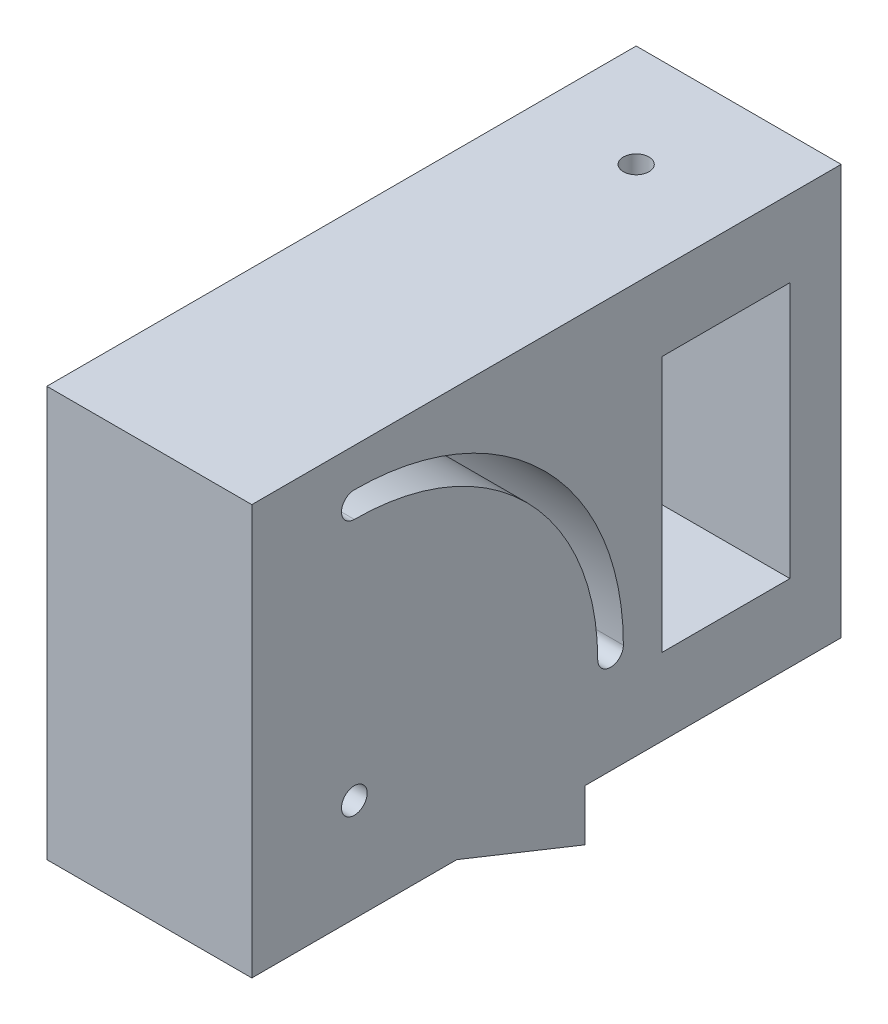
ISO-10303-21;
HEADER;
FILE_DESCRIPTION(('STEP AP214'),'2;1');
FILE_NAME('part.step','',(''),(''),'','','');
FILE_SCHEMA(('AUTOMOTIVE_DESIGN { 1 0 10303 214 1 1 1 1 }'));
ENDSEC;
DATA;
#1=APPLICATION_CONTEXT('core data for automotive mechanical design processes');
#2=APPLICATION_PROTOCOL_DEFINITION('international standard','automotive_design',2000,#1);
#3=PRODUCT_CONTEXT('',#1,'mechanical');
#4=PRODUCT('Part','Part','',(#3));
#5=PRODUCT_RELATED_PRODUCT_CATEGORY('part','',(#4));
#6=PRODUCT_DEFINITION_FORMATION('','',#4);
#7=PRODUCT_DEFINITION_CONTEXT('part definition',#1,'design');
#8=PRODUCT_DEFINITION('design','',#6,#7);
#9=PRODUCT_DEFINITION_SHAPE('','',#8);
#10=(LENGTH_UNIT() NAMED_UNIT(*) SI_UNIT(.MILLI.,.METRE.));
#11=(NAMED_UNIT(*) PLANE_ANGLE_UNIT() SI_UNIT($,.RADIAN.));
#12=(NAMED_UNIT(*) SI_UNIT($,.STERADIAN.) SOLID_ANGLE_UNIT());
#13=UNCERTAINTY_MEASURE_WITH_UNIT(LENGTH_MEASURE(1.E-05),#10,'distance_accuracy_value','');
#14=(GEOMETRIC_REPRESENTATION_CONTEXT(3) GLOBAL_UNCERTAINTY_ASSIGNED_CONTEXT((#13)) GLOBAL_UNIT_ASSIGNED_CONTEXT((#10,
#11,#12)) REPRESENTATION_CONTEXT('',''));
#15=CARTESIAN_POINT('',(0.,0.,0.));
#16=DIRECTION('',(0.,0.,1.));
#17=DIRECTION('',(1.,0.,0.));
#18=AXIS2_PLACEMENT_3D('',#15,#16,#17);
#19=CARTESIAN_POINT('',(0.,-42.059569583931,40.));
#20=DIRECTION('',(0.,0.,1.));
#21=DIRECTION('',(0.,-1.,0.));
#22=AXIS2_PLACEMENT_3D('',#19,#20,#21);
#23=PLANE('',#22);
#24=DIRECTION('',(0.,1.,0.));
#25=VECTOR('',#24,1.);
#26=CARTESIAN_POINT('',(-40.,-42.059569583931,40.));
#27=LINE('',#26,#25);
#28=CARTESIAN_POINT('',(-40.,-42.059569583931,40.));
#29=VERTEX_POINT('',#28);
#30=CARTESIAN_POINT('',(-40.,37.9404304160689,40.));
#31=VERTEX_POINT('',#30);
#32=EDGE_CURVE('E272',#29,#31,#27,.T.);
#33=ORIENTED_EDGE('',*,*,#32,.F.);
#34=DIRECTION('',(-1.,0.,0.));
#35=VECTOR('',#34,1.);
#36=CARTESIAN_POINT('',(0.,-42.059569583931,40.));
#37=LINE('',#36,#35);
#38=CARTESIAN_POINT('',(0.,-42.059569583931,40.));
#39=VERTEX_POINT('',#38);
#40=EDGE_CURVE('E227',#39,#29,#37,.T.);
#41=ORIENTED_EDGE('',*,*,#40,.F.);
#42=DIRECTION('',(0.,1.,0.));
#43=VECTOR('',#42,1.);
#44=CARTESIAN_POINT('',(0.,-42.059569583931,40.));
#45=LINE('',#44,#43);
#46=CARTESIAN_POINT('',(0.,37.9404304160689,40.));
#47=VERTEX_POINT('',#46);
#48=EDGE_CURVE('E212',#39,#47,#45,.T.);
#49=ORIENTED_EDGE('',*,*,#48,.T.);
#50=DIRECTION('',(-1.,0.,0.));
#51=VECTOR('',#50,1.);
#52=CARTESIAN_POINT('',(0.,37.9404304160689,40.));
#53=LINE('',#52,#51);
#54=EDGE_CURVE('E268',#47,#31,#53,.T.);
#55=ORIENTED_EDGE('',*,*,#54,.T.);
#56=EDGE_LOOP('',(#33,#41,#49,#55));
#57=FACE_BOUND('',#56,.T.);
#58=ADVANCED_FACE('F32',(#57),#23,.T.);
#59=CARTESIAN_POINT('',(0.,-42.0595695839308,0.));
#60=DIRECTION('',(0.,-1.,0.));
#61=DIRECTION('',(0.,0.,-1.));
#62=AXIS2_PLACEMENT_3D('',#59,#60,#61);
#63=PLANE('',#62);
#64=DIRECTION('',(0.,0.,1.));
#65=VECTOR('',#64,1.);
#66=CARTESIAN_POINT('',(-40.,-42.0595695839308,0.));
#67=LINE('',#66,#65);
#68=CARTESIAN_POINT('',(-40.,-42.0595695839308,0.));
#69=VERTEX_POINT('',#68);
#70=EDGE_CURVE('E278',#69,#29,#67,.T.);
#71=ORIENTED_EDGE('',*,*,#70,.F.);
#72=DIRECTION('',(-1.,0.,0.));
#73=VECTOR('',#72,1.);
#74=CARTESIAN_POINT('',(0.,-42.0595695839308,0.));
#75=LINE('',#74,#73);
#76=CARTESIAN_POINT('',(0.,-42.0595695839308,0.));
#77=VERTEX_POINT('',#76);
#78=EDGE_CURVE('E309',#77,#69,#75,.T.);
#79=ORIENTED_EDGE('',*,*,#78,.F.);
#80=DIRECTION('',(0.,0.,1.));
#81=VECTOR('',#80,1.);
#82=CARTESIAN_POINT('',(0.,-42.0595695839308,0.));
#83=LINE('',#82,#81);
#84=EDGE_CURVE('E283',#77,#39,#83,.T.);
#85=ORIENTED_EDGE('',*,*,#84,.T.);
#86=ORIENTED_EDGE('',*,*,#40,.T.);
#87=EDGE_LOOP('',(#71,#79,#85,#86));
#88=FACE_BOUND('',#87,.T.);
#89=ADVANCED_FACE('F314',(#88),#63,.T.);
#90=CARTESIAN_POINT('',(0.,-52.059569583931,-25.0000000000001));
#91=DIRECTION('',(0.,-0.928476690885258,0.371390676354108));
#92=DIRECTION('',(0.,-0.371390676354108,-0.928476690885258));
#93=AXIS2_PLACEMENT_3D('',#90,#91,#92);
#94=PLANE('',#93);
#95=DIRECTION('',(0.,0.371390676354108,0.928476690885258));
#96=VECTOR('',#95,1.);
#97=CARTESIAN_POINT('',(-40.,-52.059569583931,-25.0000000000001));
#98=LINE('',#97,#96);
#99=CARTESIAN_POINT('',(-40.,-52.059569583931,-25.0000000000001));
#100=VERTEX_POINT('',#99);
#101=EDGE_CURVE('E288',#100,#69,#98,.T.);
#102=ORIENTED_EDGE('',*,*,#101,.F.);
#103=DIRECTION('',(-1.,0.,0.));
#104=VECTOR('',#103,1.);
#105=CARTESIAN_POINT('',(0.,-52.059569583931,-25.0000000000001));
#106=LINE('',#105,#104);
#107=CARTESIAN_POINT('',(0.,-52.059569583931,-25.0000000000001));
#108=VERTEX_POINT('',#107);
#109=EDGE_CURVE('E306',#108,#100,#106,.T.);
#110=ORIENTED_EDGE('',*,*,#109,.F.);
#111=DIRECTION('',(0.,0.371390676354108,0.928476690885258));
#112=VECTOR('',#111,1.);
#113=CARTESIAN_POINT('',(0.,-52.059569583931,-25.0000000000001));
#114=LINE('',#113,#112);
#115=EDGE_CURVE('E296',#108,#77,#114,.T.);
#116=ORIENTED_EDGE('',*,*,#115,.T.);
#117=ORIENTED_EDGE('',*,*,#78,.T.);
#118=EDGE_LOOP('',(#102,#110,#116,#117));
#119=FACE_BOUND('',#118,.T.);
#120=ADVANCED_FACE('F326',(#119),#94,.T.);
#121=CARTESIAN_POINT('',(0.,37.9404304160689,-25.0000000000002));
#122=DIRECTION('',(0.,0.,-1.));
#123=DIRECTION('',(0.,1.,0.));
#124=AXIS2_PLACEMENT_3D('',#121,#122,#123);
#125=PLANE('',#124);
#126=DIRECTION('',(-1.,0.,0.));
#127=VECTOR('',#126,1.);
#128=CARTESIAN_POINT('',(-40.,-42.0595695839309,-25.0000000000001));
#129=LINE('',#128,#127);
#130=CARTESIAN_POINT('',(0.,-42.0595695839309,-25.0000000000001));
#131=VERTEX_POINT('',#130);
#132=CARTESIAN_POINT('',(-40.,-42.0595695839309,-25.0000000000001));
#133=VERTEX_POINT('',#132);
#134=EDGE_CURVE('E197',#131,#133,#129,.T.);
#135=ORIENTED_EDGE('',*,*,#134,.F.);
#136=DIRECTION('',(0.,-1.,0.));
#137=VECTOR('',#136,1.);
#138=CARTESIAN_POINT('',(0.,37.9404304160689,-25.0000000000002));
#139=LINE('',#138,#137);
#140=EDGE_CURVE('E294',#131,#108,#139,.T.);
#141=ORIENTED_EDGE('',*,*,#140,.T.);
#142=ORIENTED_EDGE('',*,*,#109,.T.);
#143=DIRECTION('',(0.,-1.,0.));
#144=VECTOR('',#143,1.);
#145=CARTESIAN_POINT('',(-40.,37.9404304160689,-25.0000000000002));
#146=LINE('',#145,#144);
#147=EDGE_CURVE('E271',#133,#100,#146,.T.);
#148=ORIENTED_EDGE('',*,*,#147,.F.);
#149=EDGE_LOOP('',(#135,#141,#142,#148));
#150=FACE_BOUND('',#149,.T.);
#151=ADVANCED_FACE('F263',(#150),#125,.T.);
#152=CARTESIAN_POINT('',(0.,37.9404304160689,40.));
#153=DIRECTION('',(0.,1.,0.));
#154=DIRECTION('',(0.,0.,1.));
#155=AXIS2_PLACEMENT_3D('',#152,#153,#154);
#156=PLANE('',#155);
#157=CARTESIAN_POINT('',(-20.,37.9404304160689,-55.0000000000001));
#158=DIRECTION('',(0.,1.,0.));
#159=DIRECTION('',(0.,0.,1.));
#160=AXIS2_PLACEMENT_3D('',#157,#158,#159);
#161=CIRCLE('',#160,2.50000000000003);
#162=CARTESIAN_POINT('',(-20.,37.9404304160689,-52.5000000000001));
#163=VERTEX_POINT('',#162);
#164=EDGE_CURVE('E253',#163,#163,#161,.T.);
#165=ORIENTED_EDGE('',*,*,#164,.F.);
#166=EDGE_LOOP('',(#165));
#167=FACE_BOUND('',#166,.T.);
#168=DIRECTION('',(0.,0.,-1.));
#169=VECTOR('',#168,1.);
#170=CARTESIAN_POINT('',(-40.,37.9404304160689,40.));
#171=LINE('',#170,#169);
#172=CARTESIAN_POINT('',(-40.,37.9404304160689,-75.));
#173=VERTEX_POINT('',#172);
#174=EDGE_CURVE('E266',#31,#173,#171,.T.);
#175=ORIENTED_EDGE('',*,*,#174,.F.);
#176=ORIENTED_EDGE('',*,*,#54,.F.);
#177=DIRECTION('',(0.,0.,-1.));
#178=VECTOR('',#177,1.);
#179=CARTESIAN_POINT('',(0.,37.9404304160689,40.));
#180=LINE('',#179,#178);
#181=CARTESIAN_POINT('',(0.,37.9404304160689,-75.));
#182=VERTEX_POINT('',#181);
#183=EDGE_CURVE('E297',#47,#182,#180,.T.);
#184=ORIENTED_EDGE('',*,*,#183,.T.);
#185=DIRECTION('',(1.,0.,0.));
#186=VECTOR('',#185,1.);
#187=CARTESIAN_POINT('',(0.,37.9404304160689,-75.));
#188=LINE('',#187,#186);
#189=EDGE_CURVE('E204',#173,#182,#188,.T.);
#190=ORIENTED_EDGE('',*,*,#189,.F.);
#191=EDGE_LOOP('',(#175,#176,#184,#190));
#192=FACE_BOUND('',#191,.T.);
#193=ADVANCED_FACE('F260',(#167,#192),#156,.T.);
#194=CARTESIAN_POINT('',(0.,0.,0.));
#195=DIRECTION('',(-1.,0.,0.));
#196=DIRECTION('',(0.,0.,1.));
#197=AXIS2_PLACEMENT_3D('',#194,#195,#196);
#198=PLANE('',#197);
#199=CARTESIAN_POINT('',(0.,-22.0595695839311,20.));
#200=DIRECTION('',(1.,0.,0.));
#201=DIRECTION('',(0.,0.,-1.));
#202=AXIS2_PLACEMENT_3D('',#199,#200,#201);
#203=CIRCLE('',#202,2.4999999999999);
#204=CARTESIAN_POINT('',(0.,-22.0595695839311,17.5000000000001));
#205=VERTEX_POINT('',#204);
#206=EDGE_CURVE('E247',#205,#205,#203,.T.);
#207=ORIENTED_EDGE('',*,*,#206,.F.);
#208=EDGE_LOOP('',(#207));
#209=FACE_BOUND('',#208,.T.);
#210=DIRECTION('',(0.,1.,0.));
#211=VECTOR('',#210,1.);
#212=CARTESIAN_POINT('',(0.,-27.0595695839312,-65.0000000000001));
#213=LINE('',#212,#211);
#214=CARTESIAN_POINT('',(0.,-27.0595695839312,-65.0000000000001));
#215=VERTEX_POINT('',#214);
#216=CARTESIAN_POINT('',(0.,22.9404304160689,-65.0000000000001));
#217=VERTEX_POINT('',#216);
#218=EDGE_CURVE('E149',#215,#217,#213,.T.);
#219=ORIENTED_EDGE('',*,*,#218,.F.);
#220=DIRECTION('',(0.,0.,-1.));
#221=VECTOR('',#220,1.);
#222=CARTESIAN_POINT('',(0.,-27.0595695839312,-39.9999999620001));
#223=LINE('',#222,#221);
#224=CARTESIAN_POINT('',(0.,-27.0595695839312,-39.9999999620001));
#225=VERTEX_POINT('',#224);
#226=EDGE_CURVE('E46',#225,#215,#223,.T.);
#227=ORIENTED_EDGE('',*,*,#226,.F.);
#228=DIRECTION('',(0.,-1.,0.));
#229=VECTOR('',#228,1.);
#230=CARTESIAN_POINT('',(0.,22.9404304160689,-39.9999999620001));
#231=LINE('',#230,#229);
#232=CARTESIAN_POINT('',(0.,22.9404304160689,-39.9999999620001));
#233=VERTEX_POINT('',#232);
#234=EDGE_CURVE('E156',#233,#225,#231,.T.);
#235=ORIENTED_EDGE('',*,*,#234,.F.);
#236=DIRECTION('',(0.,0.,1.));
#237=VECTOR('',#236,1.);
#238=CARTESIAN_POINT('',(0.,22.9404304160689,-65.0000000000001));
#239=LINE('',#238,#237);
#240=EDGE_CURVE('E140',#217,#233,#239,.T.);
#241=ORIENTED_EDGE('',*,*,#240,.F.);
#242=EDGE_LOOP('',(#219,#227,#235,#241));
#243=FACE_BOUND('',#242,.T.);
#244=CARTESIAN_POINT('',(0.,27.9404304160689,19.9999999999849));
#245=DIRECTION('',(-1.,0.,0.));
#246=DIRECTION('',(0.,0.,1.));
#247=AXIS2_PLACEMENT_3D('',#244,#245,#246);
#248=CIRCLE('',#247,2.50000000000001);
#249=CARTESIAN_POINT('',(0.,25.4404304160689,19.9999999999857));
#250=VERTEX_POINT('',#249);
#251=CARTESIAN_POINT('',(0.,30.4404304160689,19.9999999999841));
#252=VERTEX_POINT('',#251);
#253=EDGE_CURVE('E191',#250,#252,#248,.T.);
#254=ORIENTED_EDGE('',*,*,#253,.T.);
#255=CARTESIAN_POINT('',(0.,-22.0595695839311,20.));
#256=DIRECTION('',(-1.,0.,0.));
#257=DIRECTION('',(0.,0.,1.));
#258=AXIS2_PLACEMENT_3D('',#255,#256,#257);
#259=CIRCLE('',#258,52.5);
#260=CARTESIAN_POINT('',(0.,-22.0595695839311,-32.4999999999999));
#261=VERTEX_POINT('',#260);
#262=EDGE_CURVE('E194',#252,#261,#259,.T.);
#263=ORIENTED_EDGE('',*,*,#262,.T.);
#264=CARTESIAN_POINT('',(0.,-22.0595695839311,-29.9999999999999));
#265=DIRECTION('',(-1.,0.,0.));
#266=DIRECTION('',(0.,0.,1.));
#267=AXIS2_PLACEMENT_3D('',#264,#265,#266);
#268=CIRCLE('',#267,2.50000000000001);
#269=CARTESIAN_POINT('',(0.,-22.0595695839311,-27.4999999999999));
#270=VERTEX_POINT('',#269);
#271=EDGE_CURVE('E179',#261,#270,#268,.T.);
#272=ORIENTED_EDGE('',*,*,#271,.T.);
#273=CARTESIAN_POINT('',(0.,-22.0595695839311,20.));
#274=DIRECTION('',(-1.,0.,0.));
#275=DIRECTION('',(0.,0.,1.));
#276=AXIS2_PLACEMENT_3D('',#273,#274,#275);
#277=CIRCLE('',#276,47.5);
#278=EDGE_CURVE('E188',#270,#250,#277,.F.);
#279=ORIENTED_EDGE('',*,*,#278,.T.);
#280=EDGE_LOOP('',(#254,#263,#272,#279));
#281=FACE_BOUND('',#280,.T.);
#282=ORIENTED_EDGE('',*,*,#48,.F.);
#283=ORIENTED_EDGE('',*,*,#84,.F.);
#284=ORIENTED_EDGE('',*,*,#115,.F.);
#285=ORIENTED_EDGE('',*,*,#140,.F.);
#286=DIRECTION('',(0.,0.,1.));
#287=VECTOR('',#286,1.);
#288=CARTESIAN_POINT('',(0.,-42.059569583931,-75.));
#289=LINE('',#288,#287);
#290=CARTESIAN_POINT('',(0.,-42.059569583931,-75.));
#291=VERTEX_POINT('',#290);
#292=EDGE_CURVE('E209',#291,#131,#289,.T.);
#293=ORIENTED_EDGE('',*,*,#292,.F.);
#294=DIRECTION('',(0.,-1.,0.));
#295=VECTOR('',#294,1.);
#296=CARTESIAN_POINT('',(0.,-42.059569583931,-75.));
#297=LINE('',#296,#295);
#298=EDGE_CURVE('E207',#182,#291,#297,.T.);
#299=ORIENTED_EDGE('',*,*,#298,.F.);
#300=ORIENTED_EDGE('',*,*,#183,.F.);
#301=EDGE_LOOP('',(#282,#283,#284,#285,#293,#299,#300));
#302=FACE_BOUND('',#301,.T.);
#303=ADVANCED_FACE('F153',(#209,#243,#281,#302),#198,.F.);
#304=CARTESIAN_POINT('',(-40.,0.,0.));
#305=DIRECTION('',(-1.,0.,0.));
#306=DIRECTION('',(0.,0.,1.));
#307=AXIS2_PLACEMENT_3D('',#304,#305,#306);
#308=PLANE('',#307);
#309=CARTESIAN_POINT('',(-40.,-22.0595695839311,20.));
#310=DIRECTION('',(-1.,0.,0.));
#311=DIRECTION('',(0.,0.,1.));
#312=AXIS2_PLACEMENT_3D('',#309,#310,#311);
#313=CIRCLE('',#312,2.49999999999989);
#314=CARTESIAN_POINT('',(-40.,-22.0595695839311,22.4999999999999));
#315=VERTEX_POINT('',#314);
#316=EDGE_CURVE('E244',#315,#315,#313,.T.);
#317=ORIENTED_EDGE('',*,*,#316,.F.);
#318=EDGE_LOOP('',(#317));
#319=FACE_BOUND('',#318,.T.);
#320=DIRECTION('',(0.,0.,1.));
#321=VECTOR('',#320,1.);
#322=CARTESIAN_POINT('',(-40.,-27.0595695839312,0.));
#323=LINE('',#322,#321);
#324=CARTESIAN_POINT('',(-40.,-27.0595695839312,-65.0000000000001));
#325=VERTEX_POINT('',#324);
#326=CARTESIAN_POINT('',(-40.,-27.0595695839312,-39.9999999620001));
#327=VERTEX_POINT('',#326);
#328=EDGE_CURVE('E11',#325,#327,#323,.T.);
#329=ORIENTED_EDGE('',*,*,#328,.F.);
#330=DIRECTION('',(0.,-1.,0.));
#331=VECTOR('',#330,1.);
#332=CARTESIAN_POINT('',(-40.,0.,-65.0000000000001));
#333=LINE('',#332,#331);
#334=CARTESIAN_POINT('',(-40.,22.9404304160689,-65.0000000000001));
#335=VERTEX_POINT('',#334);
#336=EDGE_CURVE('E225',#335,#325,#333,.T.);
#337=ORIENTED_EDGE('',*,*,#336,.F.);
#338=DIRECTION('',(0.,0.,-1.));
#339=VECTOR('',#338,1.);
#340=CARTESIAN_POINT('',(-40.,22.9404304160689,0.));
#341=LINE('',#340,#339);
#342=CARTESIAN_POINT('',(-40.,22.9404304160689,-39.9999999620001));
#343=VERTEX_POINT('',#342);
#344=EDGE_CURVE('E143',#343,#335,#341,.T.);
#345=ORIENTED_EDGE('',*,*,#344,.F.);
#346=DIRECTION('',(0.,1.,0.));
#347=VECTOR('',#346,1.);
#348=CARTESIAN_POINT('',(-40.,0.,-39.9999999620001));
#349=LINE('',#348,#347);
#350=EDGE_CURVE('E39',#327,#343,#349,.T.);
#351=ORIENTED_EDGE('',*,*,#350,.F.);
#352=EDGE_LOOP('',(#329,#337,#345,#351));
#353=FACE_BOUND('',#352,.T.);
#354=CARTESIAN_POINT('',(-40.,-22.0595695839311,20.));
#355=DIRECTION('',(-1.,0.,0.));
#356=DIRECTION('',(0.,0.,1.));
#357=AXIS2_PLACEMENT_3D('',#354,#355,#356);
#358=CIRCLE('',#357,52.5);
#359=CARTESIAN_POINT('',(-40.,30.4404304160689,19.9999999999841));
#360=VERTEX_POINT('',#359);
#361=CARTESIAN_POINT('',(-40.,-22.0595695839311,-32.4999999999999));
#362=VERTEX_POINT('',#361);
#363=EDGE_CURVE('E163',#360,#362,#358,.T.);
#364=ORIENTED_EDGE('',*,*,#363,.F.);
#365=CARTESIAN_POINT('',(-40.,27.9404304160689,19.9999999999849));
#366=DIRECTION('',(-1.,0.,0.));
#367=DIRECTION('',(0.,0.,1.));
#368=AXIS2_PLACEMENT_3D('',#365,#366,#367);
#369=CIRCLE('',#368,2.50000000000001);
#370=CARTESIAN_POINT('',(-40.,25.4404304160689,19.9999999999857));
#371=VERTEX_POINT('',#370);
#372=EDGE_CURVE('E173',#371,#360,#369,.T.);
#373=ORIENTED_EDGE('',*,*,#372,.F.);
#374=CARTESIAN_POINT('',(-40.,-22.0595695839311,20.));
#375=DIRECTION('',(1.,0.,0.));
#376=DIRECTION('',(0.,0.,-1.));
#377=AXIS2_PLACEMENT_3D('',#374,#375,#376);
#378=CIRCLE('',#377,47.5);
#379=CARTESIAN_POINT('',(-40.,-22.0595695839311,-27.4999999999999));
#380=VERTEX_POINT('',#379);
#381=EDGE_CURVE('E170',#380,#371,#378,.T.);
#382=ORIENTED_EDGE('',*,*,#381,.F.);
#383=CARTESIAN_POINT('',(-40.,-22.0595695839311,-29.9999999999999));
#384=DIRECTION('',(-1.,0.,0.));
#385=DIRECTION('',(0.,0.,1.));
#386=AXIS2_PLACEMENT_3D('',#383,#384,#385);
#387=CIRCLE('',#386,2.50000000000001);
#388=EDGE_CURVE('E167',#362,#380,#387,.T.);
#389=ORIENTED_EDGE('',*,*,#388,.F.);
#390=EDGE_LOOP('',(#364,#373,#382,#389));
#391=FACE_BOUND('',#390,.T.);
#392=ORIENTED_EDGE('',*,*,#32,.T.);
#393=ORIENTED_EDGE('',*,*,#174,.T.);
#394=DIRECTION('',(0.,1.,0.));
#395=VECTOR('',#394,1.);
#396=CARTESIAN_POINT('',(-40.,37.9404304160689,-75.));
#397=LINE('',#396,#395);
#398=CARTESIAN_POINT('',(-40.,-42.0595695839309,-75.));
#399=VERTEX_POINT('',#398);
#400=EDGE_CURVE('E201',#399,#173,#397,.T.);
#401=ORIENTED_EDGE('',*,*,#400,.F.);
#402=DIRECTION('',(0.,0.,1.));
#403=VECTOR('',#402,1.);
#404=CARTESIAN_POINT('',(-40.,-42.0595695839309,-75.));
#405=LINE('',#404,#403);
#406=EDGE_CURVE('E222',#399,#133,#405,.T.);
#407=ORIENTED_EDGE('',*,*,#406,.T.);
#408=ORIENTED_EDGE('',*,*,#147,.T.);
#409=ORIENTED_EDGE('',*,*,#101,.T.);
#410=ORIENTED_EDGE('',*,*,#70,.T.);
#411=EDGE_LOOP('',(#392,#393,#401,#407,#408,#409,#410));
#412=FACE_BOUND('',#411,.T.);
#413=ADVANCED_FACE('F234',(#319,#353,#391,#412),#308,.T.);
#414=CARTESIAN_POINT('',(-40.,-42.0595695839309,-75.));
#415=DIRECTION('',(0.,1.,0.));
#416=DIRECTION('',(-1.,0.,0.));
#417=AXIS2_PLACEMENT_3D('',#414,#415,#416);
#418=PLANE('',#417);
#419=CARTESIAN_POINT('',(-20.,-42.0595695839309,-55.0000000000001));
#420=DIRECTION('',(0.,1.,0.));
#421=DIRECTION('',(-1.,0.,0.));
#422=AXIS2_PLACEMENT_3D('',#419,#420,#421);
#423=CIRCLE('',#422,2.50000000000004);
#424=CARTESIAN_POINT('',(-22.5,-42.0595695839309,-55.0000000000001));
#425=VERTEX_POINT('',#424);
#426=EDGE_CURVE('E237',#425,#425,#423,.T.);
#427=ORIENTED_EDGE('',*,*,#426,.T.);
#428=EDGE_LOOP('',(#427));
#429=FACE_BOUND('',#428,.T.);
#430=ORIENTED_EDGE('',*,*,#134,.T.);
#431=ORIENTED_EDGE('',*,*,#406,.F.);
#432=DIRECTION('',(-1.,0.,0.));
#433=VECTOR('',#432,1.);
#434=CARTESIAN_POINT('',(-40.,-42.0595695839309,-75.));
#435=LINE('',#434,#433);
#436=EDGE_CURVE('E198',#291,#399,#435,.T.);
#437=ORIENTED_EDGE('',*,*,#436,.F.);
#438=ORIENTED_EDGE('',*,*,#292,.T.);
#439=EDGE_LOOP('',(#430,#431,#437,#438));
#440=FACE_BOUND('',#439,.T.);
#441=ADVANCED_FACE('F324',(#429,#440),#418,.F.);
#442=CARTESIAN_POINT('',(0.,0.,-75.));
#443=DIRECTION('',(0.,0.,1.));
#444=DIRECTION('',(0.,-1.,0.));
#445=AXIS2_PLACEMENT_3D('',#442,#443,#444);
#446=PLANE('',#445);
#447=ORIENTED_EDGE('',*,*,#436,.T.);
#448=ORIENTED_EDGE('',*,*,#400,.T.);
#449=ORIENTED_EDGE('',*,*,#189,.T.);
#450=ORIENTED_EDGE('',*,*,#298,.T.);
#451=EDGE_LOOP('',(#447,#448,#449,#450));
#452=FACE_BOUND('',#451,.T.);
#453=ADVANCED_FACE('F320',(#452),#446,.F.);
#454=CARTESIAN_POINT('',(5.00000000014378E-05,-22.0595695839311,20.));
#455=DIRECTION('',(-1.,0.,0.));
#456=DIRECTION('',(0.,0.,1.));
#457=AXIS2_PLACEMENT_3D('',#454,#455,#456);
#458=CYLINDRICAL_SURFACE('',#457,52.5);
#459=DIRECTION('',(-1.,0.,0.));
#460=VECTOR('',#459,1.);
#461=CARTESIAN_POINT('',(5.00000000014378E-05,30.4404304160689,19.9999999999841));
#462=LINE('',#461,#460);
#463=EDGE_CURVE('E177',#252,#360,#462,.T.);
#464=ORIENTED_EDGE('',*,*,#463,.T.);
#465=ORIENTED_EDGE('',*,*,#363,.T.);
#466=DIRECTION('',(-1.,0.,0.));
#467=VECTOR('',#466,1.);
#468=CARTESIAN_POINT('',(5.00000000014378E-05,-22.0595695839311,-32.4999999999999));
#469=LINE('',#468,#467);
#470=EDGE_CURVE('E176',#261,#362,#469,.T.);
#471=ORIENTED_EDGE('',*,*,#470,.F.);
#472=ORIENTED_EDGE('',*,*,#262,.F.);
#473=EDGE_LOOP('',(#464,#465,#471,#472));
#474=FACE_BOUND('',#473,.T.);
#475=ADVANCED_FACE('F362',(#474),#458,.F.);
#476=CARTESIAN_POINT('',(5.00000000014378E-05,27.9404304160689,19.9999999999849));
#477=DIRECTION('',(-1.,0.,0.));
#478=DIRECTION('',(0.,0.,1.));
#479=AXIS2_PLACEMENT_3D('',#476,#477,#478);
#480=CYLINDRICAL_SURFACE('',#479,2.50000000000001);
#481=DIRECTION('',(-1.,0.,0.));
#482=VECTOR('',#481,1.);
#483=CARTESIAN_POINT('',(5.00000000014378E-05,25.4404304160689,19.9999999999857));
#484=LINE('',#483,#482);
#485=EDGE_CURVE('E180',#250,#371,#484,.T.);
#486=ORIENTED_EDGE('',*,*,#485,.T.);
#487=ORIENTED_EDGE('',*,*,#372,.T.);
#488=ORIENTED_EDGE('',*,*,#463,.F.);
#489=ORIENTED_EDGE('',*,*,#253,.F.);
#490=EDGE_LOOP('',(#486,#487,#488,#489));
#491=FACE_BOUND('',#490,.T.);
#492=ADVANCED_FACE('F373',(#491),#480,.F.);
#493=CARTESIAN_POINT('',(5.00000000014378E-05,-22.0595695839311,20.));
#494=DIRECTION('',(-1.,0.,0.));
#495=DIRECTION('',(0.,0.,1.));
#496=AXIS2_PLACEMENT_3D('',#493,#494,#495);
#497=CYLINDRICAL_SURFACE('',#496,47.5);
#498=DIRECTION('',(-1.,0.,0.));
#499=VECTOR('',#498,1.);
#500=CARTESIAN_POINT('',(5.00000000014378E-05,-22.0595695839311,-27.4999999999999));
#501=LINE('',#500,#499);
#502=EDGE_CURVE('E182',#270,#380,#501,.T.);
#503=ORIENTED_EDGE('',*,*,#502,.T.);
#504=ORIENTED_EDGE('',*,*,#381,.T.);
#505=ORIENTED_EDGE('',*,*,#485,.F.);
#506=ORIENTED_EDGE('',*,*,#278,.F.);
#507=EDGE_LOOP('',(#503,#504,#505,#506));
#508=FACE_BOUND('',#507,.T.);
#509=ADVANCED_FACE('F383',(#508),#497,.T.);
#510=CARTESIAN_POINT('',(5.00000000014378E-05,-22.0595695839311,-29.9999999999999));
#511=DIRECTION('',(-1.,0.,0.));
#512=DIRECTION('',(0.,0.,1.));
#513=AXIS2_PLACEMENT_3D('',#510,#511,#512);
#514=CYLINDRICAL_SURFACE('',#513,2.50000000000001);
#515=ORIENTED_EDGE('',*,*,#470,.T.);
#516=ORIENTED_EDGE('',*,*,#388,.T.);
#517=ORIENTED_EDGE('',*,*,#502,.F.);
#518=ORIENTED_EDGE('',*,*,#271,.F.);
#519=EDGE_LOOP('',(#515,#516,#517,#518));
#520=FACE_BOUND('',#519,.T.);
#521=ADVANCED_FACE('F393',(#520),#514,.F.);
#522=CARTESIAN_POINT('',(-40.00005,-27.0595695839312,-39.9999999620001));
#523=DIRECTION('',(0.,-1.,0.));
#524=DIRECTION('',(0.,0.,-1.));
#525=AXIS2_PLACEMENT_3D('',#522,#523,#524);
#526=PLANE('',#525);
#527=CARTESIAN_POINT('',(-20.,-27.0595695839314,-55.0000000000002));
#528=DIRECTION('',(0.,1.,0.));
#529=DIRECTION('',(0.,0.,1.));
#530=AXIS2_PLACEMENT_3D('',#527,#528,#529);
#531=CIRCLE('',#530,2.50000000000004);
#532=CARTESIAN_POINT('',(-20.,-27.0595695839313,-52.5000000000001));
#533=VERTEX_POINT('',#532);
#534=EDGE_CURVE('E239',#533,#533,#531,.T.);
#535=ORIENTED_EDGE('',*,*,#534,.F.);
#536=EDGE_LOOP('',(#535));
#537=FACE_BOUND('',#536,.T.);
#538=ORIENTED_EDGE('',*,*,#328,.T.);
#539=DIRECTION('',(1.,0.,0.));
#540=VECTOR('',#539,1.);
#541=CARTESIAN_POINT('',(-40.00005,-27.0595695839312,-39.9999999620001));
#542=LINE('',#541,#540);
#543=EDGE_CURVE('E161',#327,#225,#542,.T.);
#544=ORIENTED_EDGE('',*,*,#543,.T.);
#545=ORIENTED_EDGE('',*,*,#226,.T.);
#546=DIRECTION('',(1.,0.,0.));
#547=VECTOR('',#546,1.);
#548=CARTESIAN_POINT('',(-40.00005,-27.0595695839312,-65.0000000000001));
#549=LINE('',#548,#547);
#550=EDGE_CURVE('E146',#325,#215,#549,.T.);
#551=ORIENTED_EDGE('',*,*,#550,.F.);
#552=EDGE_LOOP('',(#538,#544,#545,#551));
#553=FACE_BOUND('',#552,.T.);
#554=ADVANCED_FACE('F236',(#537,#553),#526,.F.);
#555=CARTESIAN_POINT('',(-40.00005,22.9404304160689,-39.9999999620001));
#556=DIRECTION('',(0.,0.,1.));
#557=DIRECTION('',(0.,-1.,0.));
#558=AXIS2_PLACEMENT_3D('',#555,#556,#557);
#559=PLANE('',#558);
#560=ORIENTED_EDGE('',*,*,#350,.T.);
#561=DIRECTION('',(1.,0.,0.));
#562=VECTOR('',#561,1.);
#563=CARTESIAN_POINT('',(-40.00005,22.9404304160689,-39.9999999620001));
#564=LINE('',#563,#562);
#565=EDGE_CURVE('E145',#343,#233,#564,.T.);
#566=ORIENTED_EDGE('',*,*,#565,.T.);
#567=ORIENTED_EDGE('',*,*,#234,.T.);
#568=ORIENTED_EDGE('',*,*,#543,.F.);
#569=EDGE_LOOP('',(#560,#566,#567,#568));
#570=FACE_BOUND('',#569,.T.);
#571=ADVANCED_FACE('F231',(#570),#559,.F.);
#572=CARTESIAN_POINT('',(-40.00005,22.9404304160689,-65.0000000000001));
#573=DIRECTION('',(0.,1.,0.));
#574=DIRECTION('',(0.,0.,1.));
#575=AXIS2_PLACEMENT_3D('',#572,#573,#574);
#576=PLANE('',#575);
#577=CARTESIAN_POINT('',(-20.,22.9404304160689,-55.0000000000001));
#578=DIRECTION('',(0.,1.,0.));
#579=DIRECTION('',(0.,0.,1.));
#580=AXIS2_PLACEMENT_3D('',#577,#578,#579);
#581=CIRCLE('',#580,2.50000000000002);
#582=CARTESIAN_POINT('',(-20.,22.9404304160689,-52.5000000000001));
#583=VERTEX_POINT('',#582);
#584=EDGE_CURVE('E250',#583,#583,#581,.T.);
#585=ORIENTED_EDGE('',*,*,#584,.T.);
#586=EDGE_LOOP('',(#585));
#587=FACE_BOUND('',#586,.T.);
#588=ORIENTED_EDGE('',*,*,#344,.T.);
#589=DIRECTION('',(1.,0.,0.));
#590=VECTOR('',#589,1.);
#591=CARTESIAN_POINT('',(-40.00005,22.9404304160689,-65.0000000000001));
#592=LINE('',#591,#590);
#593=EDGE_CURVE('E54',#335,#217,#592,.T.);
#594=ORIENTED_EDGE('',*,*,#593,.T.);
#595=ORIENTED_EDGE('',*,*,#240,.T.);
#596=ORIENTED_EDGE('',*,*,#565,.F.);
#597=EDGE_LOOP('',(#588,#594,#595,#596));
#598=FACE_BOUND('',#597,.T.);
#599=ADVANCED_FACE('F137',(#587,#598),#576,.F.);
#600=CARTESIAN_POINT('',(-40.00005,-27.0595695839312,-65.0000000000001));
#601=DIRECTION('',(0.,0.,-1.));
#602=DIRECTION('',(-1.,0.,0.));
#603=AXIS2_PLACEMENT_3D('',#600,#601,#602);
#604=PLANE('',#603);
#605=ORIENTED_EDGE('',*,*,#336,.T.);
#606=ORIENTED_EDGE('',*,*,#550,.T.);
#607=ORIENTED_EDGE('',*,*,#218,.T.);
#608=ORIENTED_EDGE('',*,*,#593,.F.);
#609=EDGE_LOOP('',(#605,#606,#607,#608));
#610=FACE_BOUND('',#609,.T.);
#611=ADVANCED_FACE('F150',(#610),#604,.F.);
#612=CARTESIAN_POINT('',(-20.,-27.0595695839314,-55.0000000000002));
#613=DIRECTION('',(0.,1.,0.));
#614=DIRECTION('',(0.,0.,1.));
#615=AXIS2_PLACEMENT_3D('',#612,#613,#614);
#616=CYLINDRICAL_SURFACE('',#615,2.50000000000004);
#617=ORIENTED_EDGE('',*,*,#534,.T.);
#618=EDGE_LOOP('',(#617));
#619=FACE_BOUND('',#618,.T.);
#620=ORIENTED_EDGE('',*,*,#426,.F.);
#621=EDGE_LOOP('',(#620));
#622=FACE_BOUND('',#621,.T.);
#623=ADVANCED_FACE('F424',(#619,#622),#616,.F.);
#624=CARTESIAN_POINT('',(0.,-22.0595695839311,20.));
#625=DIRECTION('',(1.,0.,0.));
#626=DIRECTION('',(0.,0.,-1.));
#627=AXIS2_PLACEMENT_3D('',#624,#625,#626);
#628=CYLINDRICAL_SURFACE('',#627,2.49999999999989);
#629=ORIENTED_EDGE('',*,*,#316,.T.);
#630=EDGE_LOOP('',(#629));
#631=FACE_BOUND('',#630,.T.);
#632=ORIENTED_EDGE('',*,*,#206,.T.);
#633=EDGE_LOOP('',(#632));
#634=FACE_BOUND('',#633,.T.);
#635=ADVANCED_FACE('F449',(#631,#634),#628,.F.);
#636=CARTESIAN_POINT('',(-20.,37.9404304160689,-55.0000000000001));
#637=DIRECTION('',(0.,1.,0.));
#638=DIRECTION('',(0.,0.,1.));
#639=AXIS2_PLACEMENT_3D('',#636,#637,#638);
#640=CYLINDRICAL_SURFACE('',#639,2.50000000000002);
#641=ORIENTED_EDGE('',*,*,#164,.T.);
#642=EDGE_LOOP('',(#641));
#643=FACE_BOUND('',#642,.T.);
#644=ORIENTED_EDGE('',*,*,#584,.F.);
#645=EDGE_LOOP('',(#644));
#646=FACE_BOUND('',#645,.T.);
#647=ADVANCED_FACE('F257',(#643,#646),#640,.F.);
#648=CLOSED_SHELL('',(#58,#89,#120,#151,#193,#303,#413,#441,#453,#475,#492,#509,#521,#554,#571,
#599,#611,#623,#635,#647));
#649=MANIFOLD_SOLID_BREP('B2',#648);
#650=ADVANCED_BREP_SHAPE_REPRESENTATION('',(#18,#649),#14);
#651=SHAPE_DEFINITION_REPRESENTATION(#9,#650);
ENDSEC;
END-ISO-10303-21;
